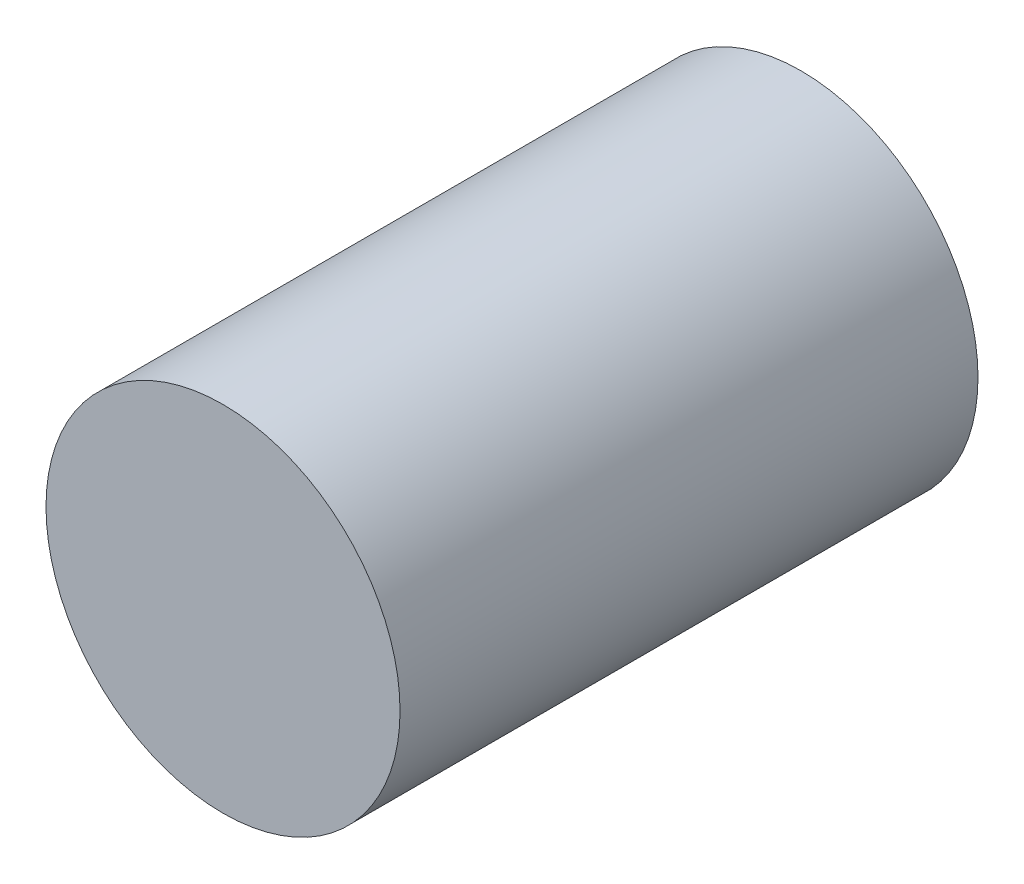
ISO-10303-21;
HEADER;
FILE_DESCRIPTION(('STEP AP214'),'2;1');
FILE_NAME('part.step','',(''),(''),'','','');
FILE_SCHEMA(('AUTOMOTIVE_DESIGN { 1 0 10303 214 1 1 1 1 }'));
ENDSEC;
DATA;
#1=APPLICATION_CONTEXT('core data for automotive mechanical design processes');
#2=APPLICATION_PROTOCOL_DEFINITION('international standard','automotive_design',2000,#1);
#3=PRODUCT_CONTEXT('',#1,'mechanical');
#4=PRODUCT('Part','Part','',(#3));
#5=PRODUCT_RELATED_PRODUCT_CATEGORY('part','',(#4));
#6=PRODUCT_DEFINITION_FORMATION('','',#4);
#7=PRODUCT_DEFINITION_CONTEXT('part definition',#1,'design');
#8=PRODUCT_DEFINITION('design','',#6,#7);
#9=PRODUCT_DEFINITION_SHAPE('','',#8);
#10=(LENGTH_UNIT() NAMED_UNIT(*) SI_UNIT(.MILLI.,.METRE.));
#11=(NAMED_UNIT(*) PLANE_ANGLE_UNIT() SI_UNIT($,.RADIAN.));
#12=(NAMED_UNIT(*) SI_UNIT($,.STERADIAN.) SOLID_ANGLE_UNIT());
#13=UNCERTAINTY_MEASURE_WITH_UNIT(LENGTH_MEASURE(1.E-05),#10,'distance_accuracy_value','');
#14=(GEOMETRIC_REPRESENTATION_CONTEXT(3) GLOBAL_UNCERTAINTY_ASSIGNED_CONTEXT((#13)) GLOBAL_UNIT_ASSIGNED_CONTEXT((#10,
#11,#12)) REPRESENTATION_CONTEXT('',''));
#15=CARTESIAN_POINT('',(0.,0.,0.));
#16=DIRECTION('',(0.,0.,1.));
#17=DIRECTION('',(1.,0.,0.));
#18=AXIS2_PLACEMENT_3D('',#15,#16,#17);
#19=CARTESIAN_POINT('',(15.,15.,-14.5271492664673));
#20=DIRECTION('',(0.,0.,1.));
#21=DIRECTION('',(1.,0.,0.));
#22=AXIS2_PLACEMENT_3D('',#19,#20,#21);
#23=CYLINDRICAL_SURFACE('',#22,6.425);
#24=CARTESIAN_POINT('',(15.,15.,-14.5271492664673));
#25=DIRECTION('',(0.,0.,1.));
#26=DIRECTION('',(1.,0.,0.));
#27=AXIS2_PLACEMENT_3D('',#24,#25,#26);
#28=CIRCLE('',#27,6.425);
#29=CARTESIAN_POINT('',(21.425,15.,-14.5271492664673));
#30=VERTEX_POINT('',#29);
#31=EDGE_CURVE('E10',#30,#30,#28,.T.);
#32=ORIENTED_EDGE('',*,*,#31,.T.);
#33=EDGE_LOOP('',(#32));
#34=FACE_BOUND('',#33,.T.);
#35=CARTESIAN_POINT('',(15.,15.,6.45));
#36=DIRECTION('',(0.,0.,1.));
#37=DIRECTION('',(1.,0.,0.));
#38=AXIS2_PLACEMENT_3D('',#35,#36,#37);
#39=CIRCLE('',#38,6.425);
#40=CARTESIAN_POINT('',(21.425,15.,6.45));
#41=VERTEX_POINT('',#40);
#42=EDGE_CURVE('E36',#41,#41,#39,.T.);
#43=ORIENTED_EDGE('',*,*,#42,.F.);
#44=EDGE_LOOP('',(#43));
#45=FACE_BOUND('',#44,.T.);
#46=ADVANCED_FACE('F30',(#34,#45),#23,.T.);
#47=CARTESIAN_POINT('',(15.,15.,-14.5271492664673));
#48=DIRECTION('',(0.,0.,1.));
#49=DIRECTION('',(1.,0.,0.));
#50=AXIS2_PLACEMENT_3D('',#47,#48,#49);
#51=PLANE('',#50);
#52=ORIENTED_EDGE('',*,*,#31,.F.);
#53=EDGE_LOOP('',(#52));
#54=FACE_BOUND('',#53,.T.);
#55=ADVANCED_FACE('F45',(#54),#51,.F.);
#56=CARTESIAN_POINT('',(15.,15.,6.45));
#57=DIRECTION('',(0.,0.,1.));
#58=DIRECTION('',(1.,0.,0.));
#59=AXIS2_PLACEMENT_3D('',#56,#57,#58);
#60=PLANE('',#59);
#61=ORIENTED_EDGE('',*,*,#42,.T.);
#62=EDGE_LOOP('',(#61));
#63=FACE_BOUND('',#62,.T.);
#64=ADVANCED_FACE('F42',(#63),#60,.T.);
#65=CLOSED_SHELL('',(#46,#55,#64));
#66=MANIFOLD_SOLID_BREP('B2',#65);
#67=ADVANCED_BREP_SHAPE_REPRESENTATION('',(#18,#66),#14);
#68=SHAPE_DEFINITION_REPRESENTATION(#9,#67);
ENDSEC;
END-ISO-10303-21;
